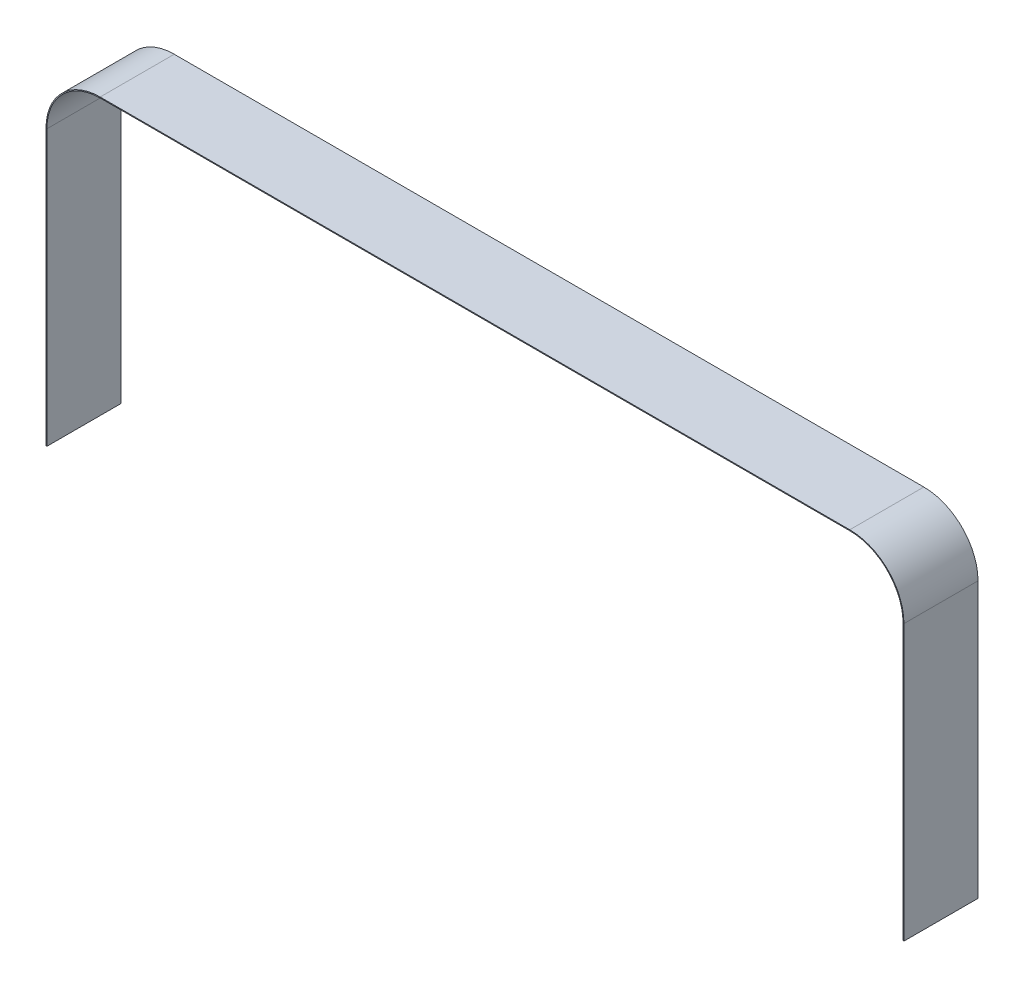
ISO-10303-21;
HEADER;
FILE_DESCRIPTION(('STEP AP214'),'2;1');
FILE_NAME('part.step','',(''),(''),'','','');
FILE_SCHEMA(('AUTOMOTIVE_DESIGN { 1 0 10303 214 1 1 1 1 }'));
ENDSEC;
DATA;
#1=APPLICATION_CONTEXT('core data for automotive mechanical design processes');
#2=APPLICATION_PROTOCOL_DEFINITION('international standard','automotive_design',2000,#1);
#3=PRODUCT_CONTEXT('',#1,'mechanical');
#4=PRODUCT('Part','Part','',(#3));
#5=PRODUCT_RELATED_PRODUCT_CATEGORY('part','',(#4));
#6=PRODUCT_DEFINITION_FORMATION('','',#4);
#7=PRODUCT_DEFINITION_CONTEXT('part definition',#1,'design');
#8=PRODUCT_DEFINITION('design','',#6,#7);
#9=PRODUCT_DEFINITION_SHAPE('','',#8);
#10=(LENGTH_UNIT() NAMED_UNIT(*) SI_UNIT(.MILLI.,.METRE.));
#11=(NAMED_UNIT(*) PLANE_ANGLE_UNIT() SI_UNIT($,.RADIAN.));
#12=(NAMED_UNIT(*) SI_UNIT($,.STERADIAN.) SOLID_ANGLE_UNIT());
#13=UNCERTAINTY_MEASURE_WITH_UNIT(LENGTH_MEASURE(1.E-05),#10,'distance_accuracy_value','');
#14=(GEOMETRIC_REPRESENTATION_CONTEXT(3) GLOBAL_UNCERTAINTY_ASSIGNED_CONTEXT((#13)) GLOBAL_UNIT_ASSIGNED_CONTEXT((#10,
#11,#12)) REPRESENTATION_CONTEXT('',''));
#15=CARTESIAN_POINT('',(0.,0.,0.));
#16=DIRECTION('',(0.,0.,1.));
#17=DIRECTION('',(1.,0.,0.));
#18=AXIS2_PLACEMENT_3D('',#15,#16,#17);
#19=CARTESIAN_POINT('',(-830.,580.,2119.05307056106));
#20=DIRECTION('',(0.,0.,-1.));
#21=DIRECTION('',(-1.,0.,0.));
#22=AXIS2_PLACEMENT_3D('',#19,#20,#21);
#23=CYLINDRICAL_SURFACE('',#22,120.);
#24=DIRECTION('',(0.,0.,-1.));
#25=VECTOR('',#24,1.);
#26=CARTESIAN_POINT('',(-950.,579.999999999999,2119.05307056106));
#27=LINE('',#26,#25);
#28=CARTESIAN_POINT('',(-950.,580.,81.9999999999999));
#29=VERTEX_POINT('',#28);
#30=CARTESIAN_POINT('',(-950.,579.999999999999,-81.9999999999999));
#31=VERTEX_POINT('',#30);
#32=EDGE_CURVE('E169',#29,#31,#27,.T.);
#33=ORIENTED_EDGE('',*,*,#32,.F.);
#34=CARTESIAN_POINT('',(-830.,580.,81.9999999999999));
#35=DIRECTION('',(0.,0.,-1.));
#36=DIRECTION('',(-1.,0.,0.));
#37=AXIS2_PLACEMENT_3D('',#34,#35,#36);
#38=CIRCLE('',#37,120.);
#39=CARTESIAN_POINT('',(-829.999999999999,700.,81.9999999999999));
#40=VERTEX_POINT('',#39);
#41=EDGE_CURVE('E36',#29,#40,#38,.T.);
#42=ORIENTED_EDGE('',*,*,#41,.T.);
#43=DIRECTION('',(0.,0.,-1.));
#44=VECTOR('',#43,1.);
#45=CARTESIAN_POINT('',(-829.999999999999,700.,2119.05307056106));
#46=LINE('',#45,#44);
#47=CARTESIAN_POINT('',(-829.999999999999,700.,-81.9999999999999));
#48=VERTEX_POINT('',#47);
#49=EDGE_CURVE('E171',#40,#48,#46,.T.);
#50=ORIENTED_EDGE('',*,*,#49,.T.);
#51=CARTESIAN_POINT('',(-830.,580.,-81.9999999999999));
#52=DIRECTION('',(0.,0.,1.));
#53=DIRECTION('',(1.,0.,0.));
#54=AXIS2_PLACEMENT_3D('',#51,#52,#53);
#55=CIRCLE('',#54,120.);
#56=EDGE_CURVE('E195',#31,#48,#55,.F.);
#57=ORIENTED_EDGE('',*,*,#56,.F.);
#58=EDGE_LOOP('',(#33,#42,#50,#57));
#59=FACE_BOUND('',#58,.T.);
#60=ADVANCED_FACE('F32',(#59),#23,.T.);
#61=CARTESIAN_POINT('',(829.999999999999,700.,2119.05307056106));
#62=DIRECTION('',(0.,-1.,0.));
#63=DIRECTION('',(0.,0.,-1.));
#64=AXIS2_PLACEMENT_3D('',#61,#62,#63);
#65=PLANE('',#64);
#66=ORIENTED_EDGE('',*,*,#49,.F.);
#67=DIRECTION('',(1.,0.,0.));
#68=VECTOR('',#67,1.);
#69=CARTESIAN_POINT('',(829.999999999999,700.,81.9999999999999));
#70=LINE('',#69,#68);
#71=CARTESIAN_POINT('',(829.999999999999,700.,81.9999999999999));
#72=VERTEX_POINT('',#71);
#73=EDGE_CURVE('E150',#40,#72,#70,.T.);
#74=ORIENTED_EDGE('',*,*,#73,.T.);
#75=DIRECTION('',(0.,0.,-1.));
#76=VECTOR('',#75,1.);
#77=CARTESIAN_POINT('',(829.999999999999,700.,2119.05307056106));
#78=LINE('',#77,#76);
#79=CARTESIAN_POINT('',(829.999999999999,700.,-81.9999999999999));
#80=VERTEX_POINT('',#79);
#81=EDGE_CURVE('E173',#72,#80,#78,.T.);
#82=ORIENTED_EDGE('',*,*,#81,.T.);
#83=DIRECTION('',(1.,0.,0.));
#84=VECTOR('',#83,1.);
#85=CARTESIAN_POINT('',(829.999999999999,700.,-81.9999999999999));
#86=LINE('',#85,#84);
#87=EDGE_CURVE('E196',#48,#80,#86,.T.);
#88=ORIENTED_EDGE('',*,*,#87,.F.);
#89=EDGE_LOOP('',(#66,#74,#82,#88));
#90=FACE_BOUND('',#89,.T.);
#91=ADVANCED_FACE('F250',(#90),#65,.F.);
#92=CARTESIAN_POINT('',(830.,580.,2119.05307056106));
#93=DIRECTION('',(0.,0.,-1.));
#94=DIRECTION('',(-1.,0.,0.));
#95=AXIS2_PLACEMENT_3D('',#92,#93,#94);
#96=CYLINDRICAL_SURFACE('',#95,120.);
#97=ORIENTED_EDGE('',*,*,#81,.F.);
#98=CARTESIAN_POINT('',(830.,580.,81.9999999999999));
#99=DIRECTION('',(0.,0.,-1.));
#100=DIRECTION('',(-1.,0.,0.));
#101=AXIS2_PLACEMENT_3D('',#98,#99,#100);
#102=CIRCLE('',#101,120.);
#103=CARTESIAN_POINT('',(950.,579.999999999999,81.9999999999999));
#104=VERTEX_POINT('',#103);
#105=EDGE_CURVE('E51',#72,#104,#102,.T.);
#106=ORIENTED_EDGE('',*,*,#105,.T.);
#107=DIRECTION('',(0.,0.,-1.));
#108=VECTOR('',#107,1.);
#109=CARTESIAN_POINT('',(950.,579.999999999999,2119.05307056106));
#110=LINE('',#109,#108);
#111=CARTESIAN_POINT('',(950.,579.999999999999,-81.9999999999999));
#112=VERTEX_POINT('',#111);
#113=EDGE_CURVE('E175',#104,#112,#110,.T.);
#114=ORIENTED_EDGE('',*,*,#113,.T.);
#115=CARTESIAN_POINT('',(830.,580.,-81.9999999999999));
#116=DIRECTION('',(0.,0.,1.));
#117=DIRECTION('',(1.,0.,0.));
#118=AXIS2_PLACEMENT_3D('',#115,#116,#117);
#119=CIRCLE('',#118,120.);
#120=EDGE_CURVE('E199',#80,#112,#119,.F.);
#121=ORIENTED_EDGE('',*,*,#120,.F.);
#122=EDGE_LOOP('',(#97,#106,#114,#121));
#123=FACE_BOUND('',#122,.T.);
#124=ADVANCED_FACE('F248',(#123),#96,.T.);
#125=CARTESIAN_POINT('',(950.,-29.0000000000002,2119.05307056106));
#126=DIRECTION('',(-1.,0.,0.));
#127=DIRECTION('',(0.,0.,1.));
#128=AXIS2_PLACEMENT_3D('',#125,#126,#127);
#129=PLANE('',#128);
#130=ORIENTED_EDGE('',*,*,#113,.F.);
#131=DIRECTION('',(0.,-1.,0.));
#132=VECTOR('',#131,1.);
#133=CARTESIAN_POINT('',(950.,-29.0000000000002,81.9999999999999));
#134=LINE('',#133,#132);
#135=CARTESIAN_POINT('',(950.,-29.0000000000002,81.9999999999999));
#136=VERTEX_POINT('',#135);
#137=EDGE_CURVE('E154',#104,#136,#134,.T.);
#138=ORIENTED_EDGE('',*,*,#137,.T.);
#139=DIRECTION('',(0.,0.,-1.));
#140=VECTOR('',#139,1.);
#141=CARTESIAN_POINT('',(950.,-29.0000000000002,2119.05307056106));
#142=LINE('',#141,#140);
#143=CARTESIAN_POINT('',(950.,-29.0000000000002,-81.9999999999999));
#144=VERTEX_POINT('',#143);
#145=EDGE_CURVE('E177',#136,#144,#142,.T.);
#146=ORIENTED_EDGE('',*,*,#145,.T.);
#147=DIRECTION('',(0.,-1.,0.));
#148=VECTOR('',#147,1.);
#149=CARTESIAN_POINT('',(950.,-29.0000000000002,-81.9999999999999));
#150=LINE('',#149,#148);
#151=EDGE_CURVE('E204',#112,#144,#150,.T.);
#152=ORIENTED_EDGE('',*,*,#151,.F.);
#153=EDGE_LOOP('',(#130,#138,#146,#152));
#154=FACE_BOUND('',#153,.T.);
#155=ADVANCED_FACE('F245',(#154),#129,.F.);
#156=CARTESIAN_POINT('',(950.,-29.0000000000002,2119.05307056106));
#157=DIRECTION('',(0.,-1.,0.));
#158=DIRECTION('',(0.,0.,-1.));
#159=AXIS2_PLACEMENT_3D('',#156,#157,#158);
#160=PLANE('',#159);
#161=DIRECTION('',(1.,0.,0.));
#162=VECTOR('',#161,1.);
#163=CARTESIAN_POINT('',(950.,-29.0000000000002,81.9999999999999));
#164=LINE('',#163,#162);
#165=CARTESIAN_POINT('',(948.,-29.0000000000002,81.9999999999999));
#166=VERTEX_POINT('',#165);
#167=EDGE_CURVE('E157',#166,#136,#164,.T.);
#168=ORIENTED_EDGE('',*,*,#167,.F.);
#169=DIRECTION('',(0.,0.,-1.));
#170=VECTOR('',#169,1.);
#171=CARTESIAN_POINT('',(948.,-29.0000000000002,2119.05307056106));
#172=LINE('',#171,#170);
#173=CARTESIAN_POINT('',(948.,-29.0000000000002,-81.9999999999999));
#174=VERTEX_POINT('',#173);
#175=EDGE_CURVE('E179',#166,#174,#172,.T.);
#176=ORIENTED_EDGE('',*,*,#175,.T.);
#177=DIRECTION('',(1.,0.,0.));
#178=VECTOR('',#177,1.);
#179=CARTESIAN_POINT('',(950.,-29.0000000000002,-81.9999999999999));
#180=LINE('',#179,#178);
#181=EDGE_CURVE('E207',#174,#144,#180,.T.);
#182=ORIENTED_EDGE('',*,*,#181,.T.);
#183=ORIENTED_EDGE('',*,*,#145,.F.);
#184=EDGE_LOOP('',(#168,#176,#182,#183));
#185=FACE_BOUND('',#184,.T.);
#186=ADVANCED_FACE('F241',(#185),#160,.T.);
#187=CARTESIAN_POINT('',(948.,-29.0000000000002,2119.05307056106));
#188=DIRECTION('',(-1.,0.,0.));
#189=DIRECTION('',(0.,0.,1.));
#190=AXIS2_PLACEMENT_3D('',#187,#188,#189);
#191=PLANE('',#190);
#192=DIRECTION('',(0.,-1.,0.));
#193=VECTOR('',#192,1.);
#194=CARTESIAN_POINT('',(948.,-29.0000000000002,81.9999999999999));
#195=LINE('',#194,#193);
#196=CARTESIAN_POINT('',(948.,579.999999999999,81.9999999999999));
#197=VERTEX_POINT('',#196);
#198=EDGE_CURVE('E159',#197,#166,#195,.T.);
#199=ORIENTED_EDGE('',*,*,#198,.F.);
#200=DIRECTION('',(0.,0.,-1.));
#201=VECTOR('',#200,1.);
#202=CARTESIAN_POINT('',(948.,579.999999999999,2119.05307056106));
#203=LINE('',#202,#201);
#204=CARTESIAN_POINT('',(948.,580.,-81.9999999999999));
#205=VERTEX_POINT('',#204);
#206=EDGE_CURVE('E181',#197,#205,#203,.T.);
#207=ORIENTED_EDGE('',*,*,#206,.T.);
#208=DIRECTION('',(0.,-1.,0.));
#209=VECTOR('',#208,1.);
#210=CARTESIAN_POINT('',(948.,-29.0000000000002,-81.9999999999999));
#211=LINE('',#210,#209);
#212=EDGE_CURVE('E210',#205,#174,#211,.T.);
#213=ORIENTED_EDGE('',*,*,#212,.T.);
#214=ORIENTED_EDGE('',*,*,#175,.F.);
#215=EDGE_LOOP('',(#199,#207,#213,#214));
#216=FACE_BOUND('',#215,.T.);
#217=ADVANCED_FACE('F236',(#216),#191,.T.);
#218=CARTESIAN_POINT('',(830.,580.,2119.05307056106));
#219=DIRECTION('',(0.,0.,-1.));
#220=DIRECTION('',(-1.,0.,0.));
#221=AXIS2_PLACEMENT_3D('',#218,#219,#220);
#222=CYLINDRICAL_SURFACE('',#221,118.);
#223=CARTESIAN_POINT('',(830.,580.,81.9999999999999));
#224=DIRECTION('',(0.,0.,-1.));
#225=DIRECTION('',(-1.,0.,0.));
#226=AXIS2_PLACEMENT_3D('',#223,#224,#225);
#227=CIRCLE('',#226,118.);
#228=CARTESIAN_POINT('',(829.999999999999,698.,81.9999999999999));
#229=VERTEX_POINT('',#228);
#230=EDGE_CURVE('E161',#229,#197,#227,.T.);
#231=ORIENTED_EDGE('',*,*,#230,.F.);
#232=DIRECTION('',(0.,0.,-1.));
#233=VECTOR('',#232,1.);
#234=CARTESIAN_POINT('',(829.999999999999,698.,2119.05307056106));
#235=LINE('',#234,#233);
#236=CARTESIAN_POINT('',(829.999999999999,698.,-81.9999999999999));
#237=VERTEX_POINT('',#236);
#238=EDGE_CURVE('E183',#229,#237,#235,.T.);
#239=ORIENTED_EDGE('',*,*,#238,.T.);
#240=CARTESIAN_POINT('',(830.,580.,-81.9999999999999));
#241=DIRECTION('',(0.,0.,1.));
#242=DIRECTION('',(1.,0.,0.));
#243=AXIS2_PLACEMENT_3D('',#240,#241,#242);
#244=CIRCLE('',#243,118.);
#245=EDGE_CURVE('E213',#237,#205,#244,.F.);
#246=ORIENTED_EDGE('',*,*,#245,.T.);
#247=ORIENTED_EDGE('',*,*,#206,.F.);
#248=EDGE_LOOP('',(#231,#239,#246,#247));
#249=FACE_BOUND('',#248,.T.);
#250=ADVANCED_FACE('F231',(#249),#222,.F.);
#251=CARTESIAN_POINT('',(829.999999999999,698.,2119.05307056106));
#252=DIRECTION('',(0.,-1.,0.));
#253=DIRECTION('',(0.,0.,-1.));
#254=AXIS2_PLACEMENT_3D('',#251,#252,#253);
#255=PLANE('',#254);
#256=DIRECTION('',(1.,0.,0.));
#257=VECTOR('',#256,1.);
#258=CARTESIAN_POINT('',(829.999999999999,698.,81.9999999999999));
#259=LINE('',#258,#257);
#260=CARTESIAN_POINT('',(-829.999999999999,698.,81.9999999999999));
#261=VERTEX_POINT('',#260);
#262=EDGE_CURVE('E163',#261,#229,#259,.T.);
#263=ORIENTED_EDGE('',*,*,#262,.F.);
#264=DIRECTION('',(0.,0.,-1.));
#265=VECTOR('',#264,1.);
#266=CARTESIAN_POINT('',(-829.999999999999,698.,2119.05307056106));
#267=LINE('',#266,#265);
#268=CARTESIAN_POINT('',(-829.999999999999,698.,-81.9999999999999));
#269=VERTEX_POINT('',#268);
#270=EDGE_CURVE('E185',#261,#269,#267,.T.);
#271=ORIENTED_EDGE('',*,*,#270,.T.);
#272=DIRECTION('',(1.,0.,0.));
#273=VECTOR('',#272,1.);
#274=CARTESIAN_POINT('',(829.999999999999,698.,-81.9999999999999));
#275=LINE('',#274,#273);
#276=EDGE_CURVE('E216',#269,#237,#275,.T.);
#277=ORIENTED_EDGE('',*,*,#276,.T.);
#278=ORIENTED_EDGE('',*,*,#238,.F.);
#279=EDGE_LOOP('',(#263,#271,#277,#278));
#280=FACE_BOUND('',#279,.T.);
#281=ADVANCED_FACE('F228',(#280),#255,.T.);
#282=CARTESIAN_POINT('',(-830.,580.,2119.05307056106));
#283=DIRECTION('',(0.,0.,-1.));
#284=DIRECTION('',(-1.,0.,0.));
#285=AXIS2_PLACEMENT_3D('',#282,#283,#284);
#286=CYLINDRICAL_SURFACE('',#285,118.);
#287=CARTESIAN_POINT('',(-830.,580.,81.9999999999999));
#288=DIRECTION('',(0.,0.,-1.));
#289=DIRECTION('',(-1.,0.,0.));
#290=AXIS2_PLACEMENT_3D('',#287,#288,#289);
#291=CIRCLE('',#290,118.);
#292=CARTESIAN_POINT('',(-948.,580.,81.9999999999999));
#293=VERTEX_POINT('',#292);
#294=EDGE_CURVE('E165',#293,#261,#291,.T.);
#295=ORIENTED_EDGE('',*,*,#294,.F.);
#296=DIRECTION('',(0.,0.,-1.));
#297=VECTOR('',#296,1.);
#298=CARTESIAN_POINT('',(-948.,579.999999999999,2119.05307056106));
#299=LINE('',#298,#297);
#300=CARTESIAN_POINT('',(-948.,579.999999999999,-81.9999999999999));
#301=VERTEX_POINT('',#300);
#302=EDGE_CURVE('E131',#293,#301,#299,.T.);
#303=ORIENTED_EDGE('',*,*,#302,.T.);
#304=CARTESIAN_POINT('',(-830.,580.,-81.9999999999999));
#305=DIRECTION('',(0.,0.,1.));
#306=DIRECTION('',(1.,0.,0.));
#307=AXIS2_PLACEMENT_3D('',#304,#305,#306);
#308=CIRCLE('',#307,118.);
#309=EDGE_CURVE('E142',#301,#269,#308,.F.);
#310=ORIENTED_EDGE('',*,*,#309,.T.);
#311=ORIENTED_EDGE('',*,*,#270,.F.);
#312=EDGE_LOOP('',(#295,#303,#310,#311));
#313=FACE_BOUND('',#312,.T.);
#314=ADVANCED_FACE('F222',(#313),#286,.F.);
#315=CARTESIAN_POINT('',(-948.,-29.0000000000002,2119.05307056106));
#316=DIRECTION('',(1.,0.,0.));
#317=DIRECTION('',(0.,0.,-1.));
#318=AXIS2_PLACEMENT_3D('',#315,#316,#317);
#319=PLANE('',#318);
#320=DIRECTION('',(0.,1.,0.));
#321=VECTOR('',#320,1.);
#322=CARTESIAN_POINT('',(-948.,-29.0000000000002,81.9999999999999));
#323=LINE('',#322,#321);
#324=CARTESIAN_POINT('',(-948.,-29.0000000000002,81.9999999999999));
#325=VERTEX_POINT('',#324);
#326=EDGE_CURVE('E76',#325,#293,#323,.T.);
#327=ORIENTED_EDGE('',*,*,#326,.F.);
#328=DIRECTION('',(0.,0.,-1.));
#329=VECTOR('',#328,1.);
#330=CARTESIAN_POINT('',(-948.,-29.0000000000002,2119.05307056106));
#331=LINE('',#330,#329);
#332=CARTESIAN_POINT('',(-948.,-29.0000000000002,-81.9999999999999));
#333=VERTEX_POINT('',#332);
#334=EDGE_CURVE('E124',#325,#333,#331,.T.);
#335=ORIENTED_EDGE('',*,*,#334,.T.);
#336=DIRECTION('',(0.,1.,0.));
#337=VECTOR('',#336,1.);
#338=CARTESIAN_POINT('',(-948.,-29.0000000000002,-81.9999999999999));
#339=LINE('',#338,#337);
#340=EDGE_CURVE('E127',#333,#301,#339,.T.);
#341=ORIENTED_EDGE('',*,*,#340,.T.);
#342=ORIENTED_EDGE('',*,*,#302,.F.);
#343=EDGE_LOOP('',(#327,#335,#341,#342));
#344=FACE_BOUND('',#343,.T.);
#345=ADVANCED_FACE('F126',(#344),#319,.T.);
#346=CARTESIAN_POINT('',(-948.,-29.0000000000002,2119.05307056106));
#347=DIRECTION('',(0.,-1.,0.));
#348=DIRECTION('',(0.,0.,-1.));
#349=AXIS2_PLACEMENT_3D('',#346,#347,#348);
#350=PLANE('',#349);
#351=DIRECTION('',(1.,0.,0.));
#352=VECTOR('',#351,1.);
#353=CARTESIAN_POINT('',(-948.,-29.0000000000002,81.9999999999999));
#354=LINE('',#353,#352);
#355=CARTESIAN_POINT('',(-950.,-29.0000000000002,81.9999999999999));
#356=VERTEX_POINT('',#355);
#357=EDGE_CURVE('E42',#356,#325,#354,.T.);
#358=ORIENTED_EDGE('',*,*,#357,.F.);
#359=DIRECTION('',(0.,0.,-1.));
#360=VECTOR('',#359,1.);
#361=CARTESIAN_POINT('',(-950.,-29.0000000000002,2119.05307056106));
#362=LINE('',#361,#360);
#363=CARTESIAN_POINT('',(-950.,-29.0000000000002,-81.9999999999999));
#364=VERTEX_POINT('',#363);
#365=EDGE_CURVE('E130',#356,#364,#362,.T.);
#366=ORIENTED_EDGE('',*,*,#365,.T.);
#367=DIRECTION('',(1.,0.,0.));
#368=VECTOR('',#367,1.);
#369=CARTESIAN_POINT('',(-948.,-29.0000000000002,-81.9999999999999));
#370=LINE('',#369,#368);
#371=EDGE_CURVE('E138',#364,#333,#370,.T.);
#372=ORIENTED_EDGE('',*,*,#371,.T.);
#373=ORIENTED_EDGE('',*,*,#334,.F.);
#374=EDGE_LOOP('',(#358,#366,#372,#373));
#375=FACE_BOUND('',#374,.T.);
#376=ADVANCED_FACE('F144',(#375),#350,.T.);
#377=CARTESIAN_POINT('',(-950.,-29.0000000000002,2119.05307056106));
#378=DIRECTION('',(1.,0.,0.));
#379=DIRECTION('',(0.,0.,-1.));
#380=AXIS2_PLACEMENT_3D('',#377,#378,#379);
#381=PLANE('',#380);
#382=ORIENTED_EDGE('',*,*,#365,.F.);
#383=DIRECTION('',(0.,1.,0.));
#384=VECTOR('',#383,1.);
#385=CARTESIAN_POINT('',(-950.,-29.0000000000002,81.9999999999999));
#386=LINE('',#385,#384);
#387=EDGE_CURVE('E11',#356,#29,#386,.T.);
#388=ORIENTED_EDGE('',*,*,#387,.T.);
#389=ORIENTED_EDGE('',*,*,#32,.T.);
#390=DIRECTION('',(0.,1.,0.));
#391=VECTOR('',#390,1.);
#392=CARTESIAN_POINT('',(-950.,-29.0000000000002,-81.9999999999999));
#393=LINE('',#392,#391);
#394=EDGE_CURVE('E148',#364,#31,#393,.T.);
#395=ORIENTED_EDGE('',*,*,#394,.F.);
#396=EDGE_LOOP('',(#382,#388,#389,#395));
#397=FACE_BOUND('',#396,.T.);
#398=ADVANCED_FACE('F34',(#397),#381,.F.);
#399=CARTESIAN_POINT('',(830.,580.,82.));
#400=DIRECTION('',(0.,0.,-1.));
#401=DIRECTION('',(-1.,0.,0.));
#402=AXIS2_PLACEMENT_3D('',#399,#400,#401);
#403=PLANE('',#402);
#404=ORIENTED_EDGE('',*,*,#357,.T.);
#405=ORIENTED_EDGE('',*,*,#326,.T.);
#406=ORIENTED_EDGE('',*,*,#294,.T.);
#407=ORIENTED_EDGE('',*,*,#262,.T.);
#408=ORIENTED_EDGE('',*,*,#230,.T.);
#409=ORIENTED_EDGE('',*,*,#198,.T.);
#410=ORIENTED_EDGE('',*,*,#167,.T.);
#411=ORIENTED_EDGE('',*,*,#137,.F.);
#412=ORIENTED_EDGE('',*,*,#105,.F.);
#413=ORIENTED_EDGE('',*,*,#73,.F.);
#414=ORIENTED_EDGE('',*,*,#41,.F.);
#415=ORIENTED_EDGE('',*,*,#387,.F.);
#416=EDGE_LOOP('',(#404,#405,#406,#407,#408,#409,#410,#411,#412,#413,#414,#415));
#417=FACE_BOUND('',#416,.T.);
#418=ADVANCED_FACE('F193',(#417),#403,.F.);
#419=CARTESIAN_POINT('',(830.,580.,-82.));
#420=DIRECTION('',(0.,0.,1.));
#421=DIRECTION('',(-1.,0.,0.));
#422=AXIS2_PLACEMENT_3D('',#419,#420,#421);
#423=PLANE('',#422);
#424=ORIENTED_EDGE('',*,*,#394,.T.);
#425=ORIENTED_EDGE('',*,*,#56,.T.);
#426=ORIENTED_EDGE('',*,*,#87,.T.);
#427=ORIENTED_EDGE('',*,*,#120,.T.);
#428=ORIENTED_EDGE('',*,*,#151,.T.);
#429=ORIENTED_EDGE('',*,*,#181,.F.);
#430=ORIENTED_EDGE('',*,*,#212,.F.);
#431=ORIENTED_EDGE('',*,*,#245,.F.);
#432=ORIENTED_EDGE('',*,*,#276,.F.);
#433=ORIENTED_EDGE('',*,*,#309,.F.);
#434=ORIENTED_EDGE('',*,*,#340,.F.);
#435=ORIENTED_EDGE('',*,*,#371,.F.);
#436=EDGE_LOOP('',(#424,#425,#426,#427,#428,#429,#430,#431,#432,#433,#434,#435));
#437=FACE_BOUND('',#436,.T.);
#438=ADVANCED_FACE('F137',(#437),#423,.F.);
#439=CLOSED_SHELL('',(#60,#91,#124,#155,#186,#217,#250,#281,#314,#345,#376,#398,#418,#438));
#440=MANIFOLD_SOLID_BREP('B2',#439);
#441=ADVANCED_BREP_SHAPE_REPRESENTATION('',(#18,#440),#14);
#442=SHAPE_DEFINITION_REPRESENTATION(#9,#441);
ENDSEC;
END-ISO-10303-21;
